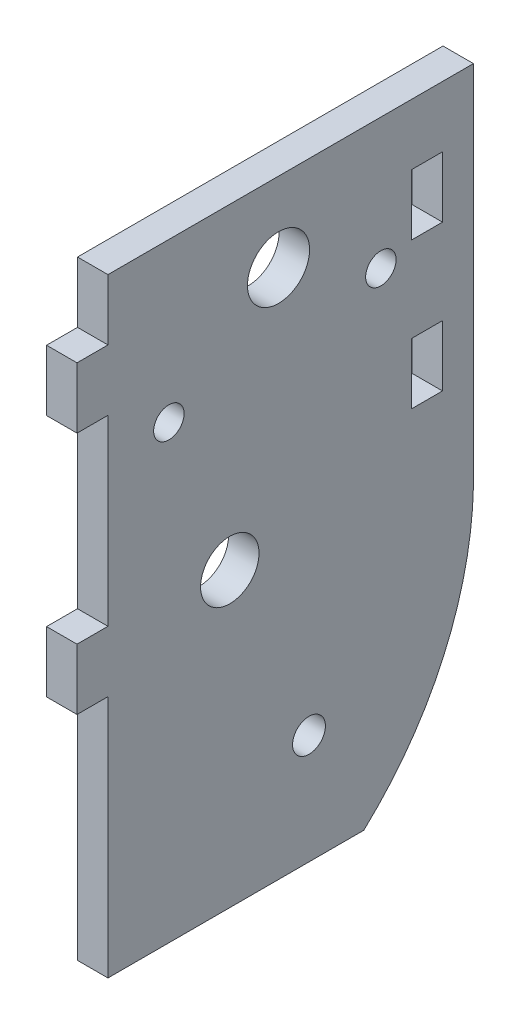
ISO-10303-21;
HEADER;
FILE_DESCRIPTION(('STEP AP214'),'2;1');
FILE_NAME('part.step','',(''),(''),'','','');
FILE_SCHEMA(('AUTOMOTIVE_DESIGN { 1 0 10303 214 1 1 1 1 }'));
ENDSEC;
DATA;
#1=APPLICATION_CONTEXT('core data for automotive mechanical design processes');
#2=APPLICATION_PROTOCOL_DEFINITION('international standard','automotive_design',2000,#1);
#3=PRODUCT_CONTEXT('',#1,'mechanical');
#4=PRODUCT('Part','Part','',(#3));
#5=PRODUCT_RELATED_PRODUCT_CATEGORY('part','',(#4));
#6=PRODUCT_DEFINITION_FORMATION('','',#4);
#7=PRODUCT_DEFINITION_CONTEXT('part definition',#1,'design');
#8=PRODUCT_DEFINITION('design','',#6,#7);
#9=PRODUCT_DEFINITION_SHAPE('','',#8);
#10=(LENGTH_UNIT() NAMED_UNIT(*) SI_UNIT(.MILLI.,.METRE.));
#11=(NAMED_UNIT(*) PLANE_ANGLE_UNIT() SI_UNIT($,.RADIAN.));
#12=(NAMED_UNIT(*) SI_UNIT($,.STERADIAN.) SOLID_ANGLE_UNIT());
#13=UNCERTAINTY_MEASURE_WITH_UNIT(LENGTH_MEASURE(1.E-05),#10,'distance_accuracy_value','');
#14=(GEOMETRIC_REPRESENTATION_CONTEXT(3) GLOBAL_UNCERTAINTY_ASSIGNED_CONTEXT((#13)) GLOBAL_UNIT_ASSIGNED_CONTEXT((#10,
#11,#12)) REPRESENTATION_CONTEXT('',''));
#15=CARTESIAN_POINT('',(0.,0.,0.));
#16=DIRECTION('',(0.,0.,1.));
#17=DIRECTION('',(1.,0.,0.));
#18=AXIS2_PLACEMENT_3D('',#15,#16,#17);
#19=CARTESIAN_POINT('',(3.175,-31.75,19.05));
#20=DIRECTION('',(0.,0.,-1.));
#21=DIRECTION('',(-1.,0.,0.));
#22=AXIS2_PLACEMENT_3D('',#19,#20,#21);
#23=PLANE('',#22);
#24=DIRECTION('',(0.,-1.,0.));
#25=VECTOR('',#24,1.);
#26=CARTESIAN_POINT('',(0.,-31.75,19.05));
#27=LINE('',#26,#25);
#28=CARTESIAN_POINT('',(0.,19.05,19.05));
#29=VERTEX_POINT('',#28);
#30=CARTESIAN_POINT('',(0.,0.,19.05));
#31=VERTEX_POINT('',#30);
#32=EDGE_CURVE('E297',#29,#31,#27,.T.);
#33=ORIENTED_EDGE('',*,*,#32,.T.);
#34=DIRECTION('',(1.,0.,0.));
#35=VECTOR('',#34,1.);
#36=CARTESIAN_POINT('',(0.,0.,19.05));
#37=LINE('',#36,#35);
#38=CARTESIAN_POINT('',(3.175,0.,19.05));
#39=VERTEX_POINT('',#38);
#40=EDGE_CURVE('E257',#31,#39,#37,.T.);
#41=ORIENTED_EDGE('',*,*,#40,.T.);
#42=DIRECTION('',(0.,-1.,0.));
#43=VECTOR('',#42,1.);
#44=CARTESIAN_POINT('',(3.175,-31.75,19.05));
#45=LINE('',#44,#43);
#46=CARTESIAN_POINT('',(3.175,19.05,19.05));
#47=VERTEX_POINT('',#46);
#48=EDGE_CURVE('E336',#47,#39,#45,.T.);
#49=ORIENTED_EDGE('',*,*,#48,.F.);
#50=DIRECTION('',(1.,0.,0.));
#51=VECTOR('',#50,1.);
#52=CARTESIAN_POINT('',(0.,19.05,19.05));
#53=LINE('',#52,#51);
#54=EDGE_CURVE('E280',#29,#47,#53,.T.);
#55=ORIENTED_EDGE('',*,*,#54,.F.);
#56=EDGE_LOOP('',(#33,#41,#49,#55));
#57=FACE_BOUND('',#56,.T.);
#58=ADVANCED_FACE('F33',(#57),#23,.F.);
#59=CARTESIAN_POINT('',(3.175,-6.35,19.05));
#60=VERTEX_POINT('',#59);
#61=CARTESIAN_POINT('',(3.175,-31.75,19.05));
#62=VERTEX_POINT('',#61);
#63=EDGE_CURVE('E299',#60,#62,#45,.T.);
#64=ORIENTED_EDGE('',*,*,#63,.F.);
#65=DIRECTION('',(1.,0.,0.));
#66=VECTOR('',#65,1.);
#67=CARTESIAN_POINT('',(0.,-6.35,19.05));
#68=LINE('',#67,#66);
#69=CARTESIAN_POINT('',(0.,-6.35,19.05));
#70=VERTEX_POINT('',#69);
#71=EDGE_CURVE('E260',#70,#60,#68,.T.);
#72=ORIENTED_EDGE('',*,*,#71,.F.);
#73=CARTESIAN_POINT('',(0.,-31.75,19.05));
#74=VERTEX_POINT('',#73);
#75=EDGE_CURVE('E294',#70,#74,#27,.T.);
#76=ORIENTED_EDGE('',*,*,#75,.T.);
#77=DIRECTION('',(-1.,0.,0.));
#78=VECTOR('',#77,1.);
#79=CARTESIAN_POINT('',(3.175,-31.75,19.05));
#80=LINE('',#79,#78);
#81=EDGE_CURVE('E322',#62,#74,#80,.T.);
#82=ORIENTED_EDGE('',*,*,#81,.F.);
#83=EDGE_LOOP('',(#64,#72,#76,#82));
#84=FACE_BOUND('',#83,.T.);
#85=ADVANCED_FACE('F401',(#84),#23,.F.);
#86=CARTESIAN_POINT('',(3.175,-31.75,-19.05));
#87=DIRECTION('',(0.,0.,1.));
#88=DIRECTION('',(1.,0.,0.));
#89=AXIS2_PLACEMENT_3D('',#86,#87,#88);
#90=PLANE('',#89);
#91=DIRECTION('',(0.,1.,0.));
#92=VECTOR('',#91,1.);
#93=CARTESIAN_POINT('',(3.175,-31.75,-19.05));
#94=LINE('',#93,#92);
#95=CARTESIAN_POINT('',(3.175,-6.35,-19.05));
#96=VERTEX_POINT('',#95);
#97=CARTESIAN_POINT('',(3.175,31.75,-19.05));
#98=VERTEX_POINT('',#97);
#99=EDGE_CURVE('E370',#96,#98,#94,.T.);
#100=ORIENTED_EDGE('',*,*,#99,.F.);
#101=DIRECTION('',(1.,0.,0.));
#102=VECTOR('',#101,1.);
#103=CARTESIAN_POINT('',(-5.00000000001367E-05,-6.35,-19.05));
#104=LINE('',#103,#102);
#105=CARTESIAN_POINT('',(0.,-6.35,-19.05));
#106=VERTEX_POINT('',#105);
#107=EDGE_CURVE('E225',#106,#96,#104,.T.);
#108=ORIENTED_EDGE('',*,*,#107,.F.);
#109=DIRECTION('',(0.,1.,0.));
#110=VECTOR('',#109,1.);
#111=CARTESIAN_POINT('',(0.,-31.75,-19.05));
#112=LINE('',#111,#110);
#113=CARTESIAN_POINT('',(0.,31.75,-19.05));
#114=VERTEX_POINT('',#113);
#115=EDGE_CURVE('E283',#106,#114,#112,.T.);
#116=ORIENTED_EDGE('',*,*,#115,.T.);
#117=DIRECTION('',(-1.,0.,0.));
#118=VECTOR('',#117,1.);
#119=CARTESIAN_POINT('',(3.175,31.75,-19.05));
#120=LINE('',#119,#118);
#121=EDGE_CURVE('E316',#98,#114,#120,.T.);
#122=ORIENTED_EDGE('',*,*,#121,.F.);
#123=EDGE_LOOP('',(#100,#108,#116,#122));
#124=FACE_BOUND('',#123,.T.);
#125=ADVANCED_FACE('F35',(#124),#90,.F.);
#126=CARTESIAN_POINT('',(3.175,31.75,19.05));
#127=DIRECTION('',(0.,-1.,0.));
#128=DIRECTION('',(0.,0.,-1.));
#129=AXIS2_PLACEMENT_3D('',#126,#127,#128);
#130=PLANE('',#129);
#131=DIRECTION('',(0.,0.,1.));
#132=VECTOR('',#131,1.);
#133=CARTESIAN_POINT('',(0.,31.75,19.05));
#134=LINE('',#133,#132);
#135=CARTESIAN_POINT('',(0.,31.75,19.05));
#136=VERTEX_POINT('',#135);
#137=EDGE_CURVE('E298',#114,#136,#134,.T.);
#138=ORIENTED_EDGE('',*,*,#137,.T.);
#139=DIRECTION('',(-1.,0.,0.));
#140=VECTOR('',#139,1.);
#141=CARTESIAN_POINT('',(3.175,31.75,19.05));
#142=LINE('',#141,#140);
#143=CARTESIAN_POINT('',(3.175,31.75,19.05));
#144=VERTEX_POINT('',#143);
#145=EDGE_CURVE('E320',#144,#136,#142,.T.);
#146=ORIENTED_EDGE('',*,*,#145,.F.);
#147=DIRECTION('',(0.,0.,1.));
#148=VECTOR('',#147,1.);
#149=CARTESIAN_POINT('',(3.175,31.75,19.05));
#150=LINE('',#149,#148);
#151=EDGE_CURVE('E371',#98,#144,#150,.T.);
#152=ORIENTED_EDGE('',*,*,#151,.F.);
#153=ORIENTED_EDGE('',*,*,#121,.T.);
#154=EDGE_LOOP('',(#138,#146,#152,#153));
#155=FACE_BOUND('',#154,.T.);
#156=ADVANCED_FACE('F346',(#155),#130,.F.);
#157=CARTESIAN_POINT('',(0.,25.4,19.05));
#158=VERTEX_POINT('',#157);
#159=EDGE_CURVE('E313',#136,#158,#27,.T.);
#160=ORIENTED_EDGE('',*,*,#159,.T.);
#161=DIRECTION('',(1.,0.,0.));
#162=VECTOR('',#161,1.);
#163=CARTESIAN_POINT('',(0.,25.4,19.05));
#164=LINE('',#163,#162);
#165=CARTESIAN_POINT('',(3.175,25.4,19.05));
#166=VERTEX_POINT('',#165);
#167=EDGE_CURVE('E287',#158,#166,#164,.T.);
#168=ORIENTED_EDGE('',*,*,#167,.T.);
#169=EDGE_CURVE('E331',#144,#166,#45,.T.);
#170=ORIENTED_EDGE('',*,*,#169,.F.);
#171=ORIENTED_EDGE('',*,*,#145,.T.);
#172=EDGE_LOOP('',(#160,#168,#170,#171));
#173=FACE_BOUND('',#172,.T.);
#174=ADVANCED_FACE('F352',(#173),#23,.F.);
#175=CARTESIAN_POINT('',(3.175,-31.75,19.05));
#176=DIRECTION('',(0.,1.,0.));
#177=DIRECTION('',(0.,0.,1.));
#178=AXIS2_PLACEMENT_3D('',#175,#176,#177);
#179=PLANE('',#178);
#180=DIRECTION('',(0.,0.,-1.));
#181=VECTOR('',#180,1.);
#182=CARTESIAN_POINT('',(0.,-31.75,19.05));
#183=LINE('',#182,#181);
#184=CARTESIAN_POINT('',(0.,-31.75,-7.62));
#185=VERTEX_POINT('',#184);
#186=EDGE_CURVE('E306',#74,#185,#183,.T.);
#187=ORIENTED_EDGE('',*,*,#186,.T.);
#188=DIRECTION('',(1.,0.,0.));
#189=VECTOR('',#188,1.);
#190=CARTESIAN_POINT('',(-5.00000000001367E-05,-31.75,-7.62));
#191=LINE('',#190,#189);
#192=CARTESIAN_POINT('',(3.175,-31.75,-7.62));
#193=VERTEX_POINT('',#192);
#194=EDGE_CURVE('E226',#185,#193,#191,.T.);
#195=ORIENTED_EDGE('',*,*,#194,.T.);
#196=DIRECTION('',(0.,0.,-1.));
#197=VECTOR('',#196,1.);
#198=CARTESIAN_POINT('',(3.175,-31.75,19.05));
#199=LINE('',#198,#197);
#200=EDGE_CURVE('E324',#62,#193,#199,.T.);
#201=ORIENTED_EDGE('',*,*,#200,.F.);
#202=ORIENTED_EDGE('',*,*,#81,.T.);
#203=EDGE_LOOP('',(#187,#195,#201,#202));
#204=FACE_BOUND('',#203,.T.);
#205=ADVANCED_FACE('F402',(#204),#179,.F.);
#206=CARTESIAN_POINT('',(3.175,31.75,-19.05));
#207=DIRECTION('',(-1.,0.,0.));
#208=DIRECTION('',(0.,0.,1.));
#209=AXIS2_PLACEMENT_3D('',#206,#207,#208);
#210=PLANE('',#209);
#211=CARTESIAN_POINT('',(3.175,18.0975,-9.39799999999999));
#212=DIRECTION('',(-1.,0.,0.));
#213=DIRECTION('',(0.,0.,1.));
#214=AXIS2_PLACEMENT_3D('',#211,#212,#213);
#215=CIRCLE('',#214,1.5875);
#216=CARTESIAN_POINT('',(3.175,18.0975,-7.81049999999999));
#217=VERTEX_POINT('',#216);
#218=EDGE_CURVE('E440',#217,#217,#215,.T.);
#219=ORIENTED_EDGE('',*,*,#218,.T.);
#220=EDGE_LOOP('',(#219));
#221=FACE_BOUND('',#220,.T.);
#222=CARTESIAN_POINT('',(3.175,15.24,12.7));
#223=DIRECTION('',(-1.,0.,0.));
#224=DIRECTION('',(0.,0.,1.));
#225=AXIS2_PLACEMENT_3D('',#222,#223,#224);
#226=CIRCLE('',#225,1.5875);
#227=CARTESIAN_POINT('',(3.175,15.24,14.2875));
#228=VERTEX_POINT('',#227);
#229=EDGE_CURVE('E434',#228,#228,#226,.T.);
#230=ORIENTED_EDGE('',*,*,#229,.T.);
#231=EDGE_LOOP('',(#230));
#232=FACE_BOUND('',#231,.T.);
#233=CARTESIAN_POINT('',(3.175,-1.27,6.35));
#234=DIRECTION('',(-1.,0.,0.));
#235=DIRECTION('',(0.,0.,1.));
#236=AXIS2_PLACEMENT_3D('',#233,#234,#235);
#237=CIRCLE('',#236,3.048);
#238=CARTESIAN_POINT('',(3.175,-1.27,9.39800000000001));
#239=VERTEX_POINT('',#238);
#240=EDGE_CURVE('E427',#239,#239,#237,.T.);
#241=ORIENTED_EDGE('',*,*,#240,.T.);
#242=EDGE_LOOP('',(#241));
#243=FACE_BOUND('',#242,.T.);
#244=DIRECTION('',(0.,0.,1.));
#245=VECTOR('',#244,1.);
#246=CARTESIAN_POINT('',(3.175,10.16,-12.5984));
#247=LINE('',#246,#245);
#248=CARTESIAN_POINT('',(3.175,10.16,-15.8242));
#249=VERTEX_POINT('',#248);
#250=CARTESIAN_POINT('',(3.175,10.16,-12.5984));
#251=VERTEX_POINT('',#250);
#252=EDGE_CURVE('E187',#249,#251,#247,.T.);
#253=ORIENTED_EDGE('',*,*,#252,.F.);
#254=DIRECTION('',(0.,1.,0.));
#255=VECTOR('',#254,1.);
#256=CARTESIAN_POINT('',(3.175,10.16,-15.8242));
#257=LINE('',#256,#255);
#258=CARTESIAN_POINT('',(3.175,3.81,-15.8242));
#259=VERTEX_POINT('',#258);
#260=EDGE_CURVE('E48',#259,#249,#257,.T.);
#261=ORIENTED_EDGE('',*,*,#260,.F.);
#262=DIRECTION('',(0.,0.,-1.));
#263=VECTOR('',#262,1.);
#264=CARTESIAN_POINT('',(3.175,3.81,-12.5984));
#265=LINE('',#264,#263);
#266=CARTESIAN_POINT('',(3.175,3.81,-12.5984));
#267=VERTEX_POINT('',#266);
#268=EDGE_CURVE('E194',#267,#259,#265,.T.);
#269=ORIENTED_EDGE('',*,*,#268,.F.);
#270=DIRECTION('',(0.,-1.,0.));
#271=VECTOR('',#270,1.);
#272=CARTESIAN_POINT('',(3.175,10.16,-12.5984));
#273=LINE('',#272,#271);
#274=EDGE_CURVE('E178',#251,#267,#273,.T.);
#275=ORIENTED_EDGE('',*,*,#274,.F.);
#276=EDGE_LOOP('',(#253,#261,#269,#275));
#277=FACE_BOUND('',#276,.T.);
#278=DIRECTION('',(0.,0.,1.));
#279=VECTOR('',#278,1.);
#280=CARTESIAN_POINT('',(3.175,25.4,-12.5984));
#281=LINE('',#280,#279);
#282=CARTESIAN_POINT('',(3.175,25.4,-15.8242));
#283=VERTEX_POINT('',#282);
#284=CARTESIAN_POINT('',(3.175,25.4,-12.5984));
#285=VERTEX_POINT('',#284);
#286=EDGE_CURVE('E205',#283,#285,#281,.T.);
#287=ORIENTED_EDGE('',*,*,#286,.F.);
#288=DIRECTION('',(0.,1.,0.));
#289=VECTOR('',#288,1.);
#290=CARTESIAN_POINT('',(3.175,25.4,-15.8242));
#291=LINE('',#290,#289);
#292=CARTESIAN_POINT('',(3.175,19.05,-15.8242));
#293=VERTEX_POINT('',#292);
#294=EDGE_CURVE('E201',#293,#283,#291,.T.);
#295=ORIENTED_EDGE('',*,*,#294,.F.);
#296=DIRECTION('',(0.,0.,-1.));
#297=VECTOR('',#296,1.);
#298=CARTESIAN_POINT('',(3.175,19.05,-12.5984));
#299=LINE('',#298,#297);
#300=CARTESIAN_POINT('',(3.175,19.05,-12.5984));
#301=VERTEX_POINT('',#300);
#302=EDGE_CURVE('E211',#301,#293,#299,.T.);
#303=ORIENTED_EDGE('',*,*,#302,.F.);
#304=DIRECTION('',(0.,-1.,0.));
#305=VECTOR('',#304,1.);
#306=CARTESIAN_POINT('',(3.175,25.4,-12.5984));
#307=LINE('',#306,#305);
#308=EDGE_CURVE('E208',#285,#301,#307,.T.);
#309=ORIENTED_EDGE('',*,*,#308,.F.);
#310=EDGE_LOOP('',(#287,#295,#303,#309));
#311=FACE_BOUND('',#310,.T.);
#312=CARTESIAN_POINT('',(3.175,23.495,1.27000000000001));
#313=DIRECTION('',(1.,0.,0.));
#314=DIRECTION('',(0.,0.,-1.));
#315=AXIS2_PLACEMENT_3D('',#312,#313,#314);
#316=CIRCLE('',#315,3.2385);
#317=CARTESIAN_POINT('',(3.175,23.495,-1.96849999999999));
#318=VERTEX_POINT('',#317);
#319=EDGE_CURVE('E229',#318,#318,#316,.T.);
#320=ORIENTED_EDGE('',*,*,#319,.F.);
#321=EDGE_LOOP('',(#320));
#322=FACE_BOUND('',#321,.T.);
#323=CARTESIAN_POINT('',(3.175,-20.32,-1.90499999999999));
#324=DIRECTION('',(1.,0.,0.));
#325=DIRECTION('',(0.,0.,-1.));
#326=AXIS2_PLACEMENT_3D('',#323,#324,#325);
#327=CIRCLE('',#326,1.7145);
#328=CARTESIAN_POINT('',(3.175,-20.32,-3.61949999999999));
#329=VERTEX_POINT('',#328);
#330=EDGE_CURVE('E234',#329,#329,#327,.T.);
#331=ORIENTED_EDGE('',*,*,#330,.F.);
#332=EDGE_LOOP('',(#331));
#333=FACE_BOUND('',#332,.T.);
#334=ORIENTED_EDGE('',*,*,#200,.T.);
#335=CARTESIAN_POINT('',(3.175,-5.62309366721289,16.5025696284158));
#336=DIRECTION('',(-1.,0.,0.));
#337=DIRECTION('',(0.,0.,1.));
#338=AXIS2_PLACEMENT_3D('',#335,#336,#337);
#339=CIRCLE('',#338,35.56);
#340=EDGE_CURVE('E217',#96,#193,#339,.T.);
#341=ORIENTED_EDGE('',*,*,#340,.F.);
#342=ORIENTED_EDGE('',*,*,#99,.T.);
#343=ORIENTED_EDGE('',*,*,#151,.T.);
#344=ORIENTED_EDGE('',*,*,#169,.T.);
#345=DIRECTION('',(0.,0.,1.));
#346=VECTOR('',#345,1.);
#347=CARTESIAN_POINT('',(3.175,25.4,19.05));
#348=LINE('',#347,#346);
#349=CARTESIAN_POINT('',(3.175,25.4,22.2758));
#350=VERTEX_POINT('',#349);
#351=EDGE_CURVE('E259',#166,#350,#348,.T.);
#352=ORIENTED_EDGE('',*,*,#351,.T.);
#353=DIRECTION('',(0.,-1.,0.));
#354=VECTOR('',#353,1.);
#355=CARTESIAN_POINT('',(3.175,25.4,22.2758));
#356=LINE('',#355,#354);
#357=CARTESIAN_POINT('',(3.175,19.05,22.2758));
#358=VERTEX_POINT('',#357);
#359=EDGE_CURVE('E271',#350,#358,#356,.T.);
#360=ORIENTED_EDGE('',*,*,#359,.T.);
#361=DIRECTION('',(0.,0.,-1.));
#362=VECTOR('',#361,1.);
#363=CARTESIAN_POINT('',(3.175,19.05,22.2758));
#364=LINE('',#363,#362);
#365=EDGE_CURVE('E274',#358,#47,#364,.T.);
#366=ORIENTED_EDGE('',*,*,#365,.T.);
#367=ORIENTED_EDGE('',*,*,#48,.T.);
#368=DIRECTION('',(0.,0.,1.));
#369=VECTOR('',#368,1.);
#370=CARTESIAN_POINT('',(3.175,0.,22.2758));
#371=LINE('',#370,#369);
#372=CARTESIAN_POINT('',(3.175,0.,22.2758));
#373=VERTEX_POINT('',#372);
#374=EDGE_CURVE('E249',#39,#373,#371,.T.);
#375=ORIENTED_EDGE('',*,*,#374,.T.);
#376=DIRECTION('',(0.,-1.,0.));
#377=VECTOR('',#376,1.);
#378=CARTESIAN_POINT('',(3.175,-6.35,22.2758));
#379=LINE('',#378,#377);
#380=CARTESIAN_POINT('',(3.175,-6.35,22.2758));
#381=VERTEX_POINT('',#380);
#382=EDGE_CURVE('E252',#373,#381,#379,.T.);
#383=ORIENTED_EDGE('',*,*,#382,.T.);
#384=DIRECTION('',(0.,0.,-1.));
#385=VECTOR('',#384,1.);
#386=CARTESIAN_POINT('',(3.175,-6.35,19.05));
#387=LINE('',#386,#385);
#388=EDGE_CURVE('E242',#381,#60,#387,.T.);
#389=ORIENTED_EDGE('',*,*,#388,.T.);
#390=ORIENTED_EDGE('',*,*,#63,.T.);
#391=EDGE_LOOP('',(#334,#341,#342,#343,#344,#352,#360,#366,#367,#375,#383,#389,#390));
#392=FACE_BOUND('',#391,.T.);
#393=ADVANCED_FACE('F191',(#221,#232,#243,#277,#311,#322,#333,#392),#210,.F.);
#394=CARTESIAN_POINT('',(0.,31.75,-19.05));
#395=DIRECTION('',(-1.,0.,0.));
#396=DIRECTION('',(0.,0.,1.));
#397=AXIS2_PLACEMENT_3D('',#394,#395,#396);
#398=PLANE('',#397);
#399=CARTESIAN_POINT('',(0.,18.0975,-9.39799999999999));
#400=DIRECTION('',(-1.,0.,0.));
#401=DIRECTION('',(0.,0.,1.));
#402=AXIS2_PLACEMENT_3D('',#399,#400,#401);
#403=CIRCLE('',#402,1.5875);
#404=CARTESIAN_POINT('',(0.,18.0975,-7.81049999999999));
#405=VERTEX_POINT('',#404);
#406=EDGE_CURVE('E443',#405,#405,#403,.T.);
#407=ORIENTED_EDGE('',*,*,#406,.F.);
#408=EDGE_LOOP('',(#407));
#409=FACE_BOUND('',#408,.T.);
#410=CARTESIAN_POINT('',(0.,15.24,12.7));
#411=DIRECTION('',(-1.,0.,0.));
#412=DIRECTION('',(0.,0.,1.));
#413=AXIS2_PLACEMENT_3D('',#410,#411,#412);
#414=CIRCLE('',#413,1.5875);
#415=CARTESIAN_POINT('',(0.,15.24,14.2875));
#416=VERTEX_POINT('',#415);
#417=EDGE_CURVE('E437',#416,#416,#414,.T.);
#418=ORIENTED_EDGE('',*,*,#417,.F.);
#419=EDGE_LOOP('',(#418));
#420=FACE_BOUND('',#419,.T.);
#421=CARTESIAN_POINT('',(0.,-1.27,6.35));
#422=DIRECTION('',(-1.,0.,0.));
#423=DIRECTION('',(0.,0.,1.));
#424=AXIS2_PLACEMENT_3D('',#421,#422,#423);
#425=CIRCLE('',#424,3.048);
#426=CARTESIAN_POINT('',(0.,-1.27,9.39800000000001));
#427=VERTEX_POINT('',#426);
#428=EDGE_CURVE('E429',#427,#427,#425,.T.);
#429=ORIENTED_EDGE('',*,*,#428,.F.);
#430=EDGE_LOOP('',(#429));
#431=FACE_BOUND('',#430,.T.);
#432=DIRECTION('',(0.,-1.,0.));
#433=VECTOR('',#432,1.);
#434=CARTESIAN_POINT('',(0.,31.75,-15.8242));
#435=LINE('',#434,#433);
#436=CARTESIAN_POINT('',(0.,10.16,-15.8242));
#437=VERTEX_POINT('',#436);
#438=CARTESIAN_POINT('',(0.,3.81,-15.8242));
#439=VERTEX_POINT('',#438);
#440=EDGE_CURVE('E11',#437,#439,#435,.T.);
#441=ORIENTED_EDGE('',*,*,#440,.F.);
#442=DIRECTION('',(0.,0.,-1.));
#443=VECTOR('',#442,1.);
#444=CARTESIAN_POINT('',(0.,10.16,-19.05));
#445=LINE('',#444,#443);
#446=CARTESIAN_POINT('',(0.,10.16,-12.5984));
#447=VERTEX_POINT('',#446);
#448=EDGE_CURVE('E417',#447,#437,#445,.T.);
#449=ORIENTED_EDGE('',*,*,#448,.F.);
#450=DIRECTION('',(0.,1.,0.));
#451=VECTOR('',#450,1.);
#452=CARTESIAN_POINT('',(0.,31.75,-12.5984));
#453=LINE('',#452,#451);
#454=CARTESIAN_POINT('',(0.,3.81,-12.5984));
#455=VERTEX_POINT('',#454);
#456=EDGE_CURVE('E181',#455,#447,#453,.T.);
#457=ORIENTED_EDGE('',*,*,#456,.F.);
#458=DIRECTION('',(0.,0.,1.));
#459=VECTOR('',#458,1.);
#460=CARTESIAN_POINT('',(0.,3.81,-19.05));
#461=LINE('',#460,#459);
#462=EDGE_CURVE('E41',#439,#455,#461,.T.);
#463=ORIENTED_EDGE('',*,*,#462,.F.);
#464=EDGE_LOOP('',(#441,#449,#457,#463));
#465=FACE_BOUND('',#464,.T.);
#466=DIRECTION('',(0.,-1.,0.));
#467=VECTOR('',#466,1.);
#468=CARTESIAN_POINT('',(0.,31.75,-15.8242));
#469=LINE('',#468,#467);
#470=CARTESIAN_POINT('',(0.,25.4,-15.8242));
#471=VERTEX_POINT('',#470);
#472=CARTESIAN_POINT('',(0.,19.05,-15.8242));
#473=VERTEX_POINT('',#472);
#474=EDGE_CURVE('E415',#471,#473,#469,.T.);
#475=ORIENTED_EDGE('',*,*,#474,.F.);
#476=DIRECTION('',(0.,0.,-1.));
#477=VECTOR('',#476,1.);
#478=CARTESIAN_POINT('',(0.,25.4,-19.05));
#479=LINE('',#478,#477);
#480=CARTESIAN_POINT('',(0.,25.4,-12.5984));
#481=VERTEX_POINT('',#480);
#482=EDGE_CURVE('E405',#481,#471,#479,.T.);
#483=ORIENTED_EDGE('',*,*,#482,.F.);
#484=DIRECTION('',(0.,1.,0.));
#485=VECTOR('',#484,1.);
#486=CARTESIAN_POINT('',(0.,31.75,-12.5984));
#487=LINE('',#486,#485);
#488=CARTESIAN_POINT('',(0.,19.05,-12.5984));
#489=VERTEX_POINT('',#488);
#490=EDGE_CURVE('E407',#489,#481,#487,.T.);
#491=ORIENTED_EDGE('',*,*,#490,.F.);
#492=DIRECTION('',(0.,0.,1.));
#493=VECTOR('',#492,1.);
#494=CARTESIAN_POINT('',(0.,19.05,-19.05));
#495=LINE('',#494,#493);
#496=EDGE_CURVE('E413',#473,#489,#495,.T.);
#497=ORIENTED_EDGE('',*,*,#496,.F.);
#498=EDGE_LOOP('',(#475,#483,#491,#497));
#499=FACE_BOUND('',#498,.T.);
#500=CARTESIAN_POINT('',(0.,-5.62309366721289,16.5025696284158));
#501=DIRECTION('',(-1.,0.,0.));
#502=DIRECTION('',(0.,0.,1.));
#503=AXIS2_PLACEMENT_3D('',#500,#501,#502);
#504=CIRCLE('',#503,35.56);
#505=EDGE_CURVE('E319',#185,#106,#504,.F.);
#506=ORIENTED_EDGE('',*,*,#505,.F.);
#507=ORIENTED_EDGE('',*,*,#186,.F.);
#508=ORIENTED_EDGE('',*,*,#75,.F.);
#509=DIRECTION('',(0.,0.,-1.));
#510=VECTOR('',#509,1.);
#511=CARTESIAN_POINT('',(0.,-6.35,19.05));
#512=LINE('',#511,#510);
#513=CARTESIAN_POINT('',(0.,-6.35,22.2758));
#514=VERTEX_POINT('',#513);
#515=EDGE_CURVE('E245',#514,#70,#512,.T.);
#516=ORIENTED_EDGE('',*,*,#515,.F.);
#517=DIRECTION('',(0.,-1.,0.));
#518=VECTOR('',#517,1.);
#519=CARTESIAN_POINT('',(0.,-6.35,22.2758));
#520=LINE('',#519,#518);
#521=CARTESIAN_POINT('',(0.,0.,22.2758));
#522=VERTEX_POINT('',#521);
#523=EDGE_CURVE('E241',#522,#514,#520,.T.);
#524=ORIENTED_EDGE('',*,*,#523,.F.);
#525=DIRECTION('',(0.,0.,1.));
#526=VECTOR('',#525,1.);
#527=CARTESIAN_POINT('',(0.,0.,22.2758));
#528=LINE('',#527,#526);
#529=EDGE_CURVE('E238',#31,#522,#528,.T.);
#530=ORIENTED_EDGE('',*,*,#529,.F.);
#531=ORIENTED_EDGE('',*,*,#32,.F.);
#532=DIRECTION('',(0.,0.,-1.));
#533=VECTOR('',#532,1.);
#534=CARTESIAN_POINT('',(0.,19.05,22.2758));
#535=LINE('',#534,#533);
#536=CARTESIAN_POINT('',(0.,19.05,22.2758));
#537=VERTEX_POINT('',#536);
#538=EDGE_CURVE('E269',#537,#29,#535,.T.);
#539=ORIENTED_EDGE('',*,*,#538,.F.);
#540=DIRECTION('',(0.,-1.,0.));
#541=VECTOR('',#540,1.);
#542=CARTESIAN_POINT('',(0.,25.4,22.2758));
#543=LINE('',#542,#541);
#544=CARTESIAN_POINT('',(0.,25.4,22.2758));
#545=VERTEX_POINT('',#544);
#546=EDGE_CURVE('E266',#545,#537,#543,.T.);
#547=ORIENTED_EDGE('',*,*,#546,.F.);
#548=DIRECTION('',(0.,0.,1.));
#549=VECTOR('',#548,1.);
#550=CARTESIAN_POINT('',(0.,25.4,19.05));
#551=LINE('',#550,#549);
#552=EDGE_CURVE('E270',#158,#545,#551,.T.);
#553=ORIENTED_EDGE('',*,*,#552,.F.);
#554=ORIENTED_EDGE('',*,*,#159,.F.);
#555=ORIENTED_EDGE('',*,*,#137,.F.);
#556=ORIENTED_EDGE('',*,*,#115,.F.);
#557=EDGE_LOOP('',(#506,#507,#508,#516,#524,#530,#531,#539,#547,#553,#554,#555,#556));
#558=FACE_BOUND('',#557,.T.);
#559=CARTESIAN_POINT('',(0.,23.495,1.27000000000001));
#560=DIRECTION('',(-1.,0.,0.));
#561=DIRECTION('',(0.,0.,1.));
#562=AXIS2_PLACEMENT_3D('',#559,#560,#561);
#563=CIRCLE('',#562,3.2385);
#564=CARTESIAN_POINT('',(0.,23.495,4.50850000000001));
#565=VERTEX_POINT('',#564);
#566=EDGE_CURVE('E233',#565,#565,#563,.T.);
#567=ORIENTED_EDGE('',*,*,#566,.F.);
#568=EDGE_LOOP('',(#567));
#569=FACE_BOUND('',#568,.T.);
#570=CARTESIAN_POINT('',(0.,-20.32,-1.90499999999999));
#571=DIRECTION('',(-1.,0.,0.));
#572=DIRECTION('',(0.,0.,1.));
#573=AXIS2_PLACEMENT_3D('',#570,#571,#572);
#574=CIRCLE('',#573,1.7145);
#575=CARTESIAN_POINT('',(0.,-20.32,-0.190499999999994));
#576=VERTEX_POINT('',#575);
#577=EDGE_CURVE('E237',#576,#576,#574,.T.);
#578=ORIENTED_EDGE('',*,*,#577,.F.);
#579=EDGE_LOOP('',(#578));
#580=FACE_BOUND('',#579,.T.);
#581=ADVANCED_FACE('F356',(#409,#420,#431,#465,#499,#558,#569,#580),#398,.T.);
#582=CARTESIAN_POINT('',(0.,19.05,22.2758));
#583=DIRECTION('',(0.,-1.,0.));
#584=DIRECTION('',(0.,0.,-1.));
#585=AXIS2_PLACEMENT_3D('',#582,#583,#584);
#586=PLANE('',#585);
#587=ORIENTED_EDGE('',*,*,#365,.F.);
#588=DIRECTION('',(1.,0.,0.));
#589=VECTOR('',#588,1.);
#590=CARTESIAN_POINT('',(0.,19.05,22.2758));
#591=LINE('',#590,#589);
#592=EDGE_CURVE('E277',#537,#358,#591,.T.);
#593=ORIENTED_EDGE('',*,*,#592,.F.);
#594=ORIENTED_EDGE('',*,*,#538,.T.);
#595=ORIENTED_EDGE('',*,*,#54,.T.);
#596=EDGE_LOOP('',(#587,#593,#594,#595));
#597=FACE_BOUND('',#596,.T.);
#598=ADVANCED_FACE('F383',(#597),#586,.T.);
#599=CARTESIAN_POINT('',(0.,25.4,22.2758));
#600=DIRECTION('',(0.,0.,1.));
#601=DIRECTION('',(0.,-1.,0.));
#602=AXIS2_PLACEMENT_3D('',#599,#600,#601);
#603=PLANE('',#602);
#604=ORIENTED_EDGE('',*,*,#359,.F.);
#605=DIRECTION('',(1.,0.,0.));
#606=VECTOR('',#605,1.);
#607=CARTESIAN_POINT('',(0.,25.4,22.2758));
#608=LINE('',#607,#606);
#609=EDGE_CURVE('E365',#545,#350,#608,.T.);
#610=ORIENTED_EDGE('',*,*,#609,.F.);
#611=ORIENTED_EDGE('',*,*,#546,.T.);
#612=ORIENTED_EDGE('',*,*,#592,.T.);
#613=EDGE_LOOP('',(#604,#610,#611,#612));
#614=FACE_BOUND('',#613,.T.);
#615=ADVANCED_FACE('F381',(#614),#603,.T.);
#616=CARTESIAN_POINT('',(0.,25.4,19.05));
#617=DIRECTION('',(0.,1.,0.));
#618=DIRECTION('',(0.,0.,1.));
#619=AXIS2_PLACEMENT_3D('',#616,#617,#618);
#620=PLANE('',#619);
#621=ORIENTED_EDGE('',*,*,#351,.F.);
#622=ORIENTED_EDGE('',*,*,#167,.F.);
#623=ORIENTED_EDGE('',*,*,#552,.T.);
#624=ORIENTED_EDGE('',*,*,#609,.T.);
#625=EDGE_LOOP('',(#621,#622,#623,#624));
#626=FACE_BOUND('',#625,.T.);
#627=ADVANCED_FACE('F379',(#626),#620,.T.);
#628=CARTESIAN_POINT('',(0.,0.,22.2758));
#629=DIRECTION('',(0.,1.,0.));
#630=DIRECTION('',(0.,0.,1.));
#631=AXIS2_PLACEMENT_3D('',#628,#629,#630);
#632=PLANE('',#631);
#633=ORIENTED_EDGE('',*,*,#374,.F.);
#634=ORIENTED_EDGE('',*,*,#40,.F.);
#635=ORIENTED_EDGE('',*,*,#529,.T.);
#636=DIRECTION('',(1.,0.,0.));
#637=VECTOR('',#636,1.);
#638=CARTESIAN_POINT('',(0.,0.,22.2758));
#639=LINE('',#638,#637);
#640=EDGE_CURVE('E248',#522,#373,#639,.T.);
#641=ORIENTED_EDGE('',*,*,#640,.T.);
#642=EDGE_LOOP('',(#633,#634,#635,#641));
#643=FACE_BOUND('',#642,.T.);
#644=ADVANCED_FACE('F390',(#643),#632,.T.);
#645=CARTESIAN_POINT('',(0.,-6.35,19.05));
#646=DIRECTION('',(0.,-1.,0.));
#647=DIRECTION('',(0.,0.,-1.));
#648=AXIS2_PLACEMENT_3D('',#645,#646,#647);
#649=PLANE('',#648);
#650=ORIENTED_EDGE('',*,*,#388,.F.);
#651=DIRECTION('',(1.,0.,0.));
#652=VECTOR('',#651,1.);
#653=CARTESIAN_POINT('',(0.,-6.35,22.2758));
#654=LINE('',#653,#652);
#655=EDGE_CURVE('E263',#514,#381,#654,.T.);
#656=ORIENTED_EDGE('',*,*,#655,.F.);
#657=ORIENTED_EDGE('',*,*,#515,.T.);
#658=ORIENTED_EDGE('',*,*,#71,.T.);
#659=EDGE_LOOP('',(#650,#656,#657,#658));
#660=FACE_BOUND('',#659,.T.);
#661=ADVANCED_FACE('F398',(#660),#649,.T.);
#662=CARTESIAN_POINT('',(0.,-6.35,22.2758));
#663=DIRECTION('',(0.,0.,1.));
#664=DIRECTION('',(1.,0.,0.));
#665=AXIS2_PLACEMENT_3D('',#662,#663,#664);
#666=PLANE('',#665);
#667=ORIENTED_EDGE('',*,*,#382,.F.);
#668=ORIENTED_EDGE('',*,*,#640,.F.);
#669=ORIENTED_EDGE('',*,*,#523,.T.);
#670=ORIENTED_EDGE('',*,*,#655,.T.);
#671=EDGE_LOOP('',(#667,#668,#669,#670));
#672=FACE_BOUND('',#671,.T.);
#673=ADVANCED_FACE('F395',(#672),#666,.T.);
#674=CARTESIAN_POINT('',(-5.00000000001367E-05,-20.32,-1.90499999999999));
#675=DIRECTION('',(1.,0.,0.));
#676=DIRECTION('',(0.,0.,-1.));
#677=AXIS2_PLACEMENT_3D('',#674,#675,#676);
#678=CYLINDRICAL_SURFACE('',#677,1.7145);
#679=ORIENTED_EDGE('',*,*,#577,.T.);
#680=EDGE_LOOP('',(#679));
#681=FACE_BOUND('',#680,.T.);
#682=ORIENTED_EDGE('',*,*,#330,.T.);
#683=EDGE_LOOP('',(#682));
#684=FACE_BOUND('',#683,.T.);
#685=ADVANCED_FACE('F552',(#681,#684),#678,.F.);
#686=CARTESIAN_POINT('',(-5.00000000001367E-05,23.495,1.27000000000001));
#687=DIRECTION('',(1.,0.,0.));
#688=DIRECTION('',(0.,0.,-1.));
#689=AXIS2_PLACEMENT_3D('',#686,#687,#688);
#690=CYLINDRICAL_SURFACE('',#689,3.2385);
#691=ORIENTED_EDGE('',*,*,#566,.T.);
#692=EDGE_LOOP('',(#691));
#693=FACE_BOUND('',#692,.T.);
#694=ORIENTED_EDGE('',*,*,#319,.T.);
#695=EDGE_LOOP('',(#694));
#696=FACE_BOUND('',#695,.T.);
#697=ADVANCED_FACE('F560',(#693,#696),#690,.F.);
#698=CARTESIAN_POINT('',(-5.00000000001367E-05,-5.62309366721289,16.5025696284158));
#699=DIRECTION('',(1.,0.,0.));
#700=DIRECTION('',(0.,0.,-1.));
#701=AXIS2_PLACEMENT_3D('',#698,#699,#700);
#702=CYLINDRICAL_SURFACE('',#701,35.56);
#703=ORIENTED_EDGE('',*,*,#505,.T.);
#704=ORIENTED_EDGE('',*,*,#107,.T.);
#705=ORIENTED_EDGE('',*,*,#340,.T.);
#706=ORIENTED_EDGE('',*,*,#194,.F.);
#707=EDGE_LOOP('',(#703,#704,#705,#706));
#708=FACE_BOUND('',#707,.T.);
#709=ADVANCED_FACE('F404',(#708),#702,.T.);
#710=CARTESIAN_POINT('',(-5.00000000001367E-05,25.4,-15.8242));
#711=DIRECTION('',(0.,0.,-1.));
#712=DIRECTION('',(-1.,0.,0.));
#713=AXIS2_PLACEMENT_3D('',#710,#711,#712);
#714=PLANE('',#713);
#715=ORIENTED_EDGE('',*,*,#474,.T.);
#716=DIRECTION('',(1.,0.,0.));
#717=VECTOR('',#716,1.);
#718=CARTESIAN_POINT('',(-5.00000000001367E-05,19.05,-15.8242));
#719=LINE('',#718,#717);
#720=EDGE_CURVE('E215',#473,#293,#719,.T.);
#721=ORIENTED_EDGE('',*,*,#720,.T.);
#722=ORIENTED_EDGE('',*,*,#294,.T.);
#723=DIRECTION('',(1.,0.,0.));
#724=VECTOR('',#723,1.);
#725=CARTESIAN_POINT('',(-5.00000000001367E-05,25.4,-15.8242));
#726=LINE('',#725,#724);
#727=EDGE_CURVE('E214',#471,#283,#726,.T.);
#728=ORIENTED_EDGE('',*,*,#727,.F.);
#729=EDGE_LOOP('',(#715,#721,#722,#728));
#730=FACE_BOUND('',#729,.T.);
#731=ADVANCED_FACE('F579',(#730),#714,.F.);
#732=CARTESIAN_POINT('',(-5.00000000001367E-05,19.05,-12.5984));
#733=DIRECTION('',(0.,-1.,0.));
#734=DIRECTION('',(0.,0.,-1.));
#735=AXIS2_PLACEMENT_3D('',#732,#733,#734);
#736=PLANE('',#735);
#737=ORIENTED_EDGE('',*,*,#496,.T.);
#738=DIRECTION('',(1.,0.,0.));
#739=VECTOR('',#738,1.);
#740=CARTESIAN_POINT('',(-5.00000000001367E-05,19.05,-12.5984));
#741=LINE('',#740,#739);
#742=EDGE_CURVE('E218',#489,#301,#741,.T.);
#743=ORIENTED_EDGE('',*,*,#742,.T.);
#744=ORIENTED_EDGE('',*,*,#302,.T.);
#745=ORIENTED_EDGE('',*,*,#720,.F.);
#746=EDGE_LOOP('',(#737,#743,#744,#745));
#747=FACE_BOUND('',#746,.T.);
#748=ADVANCED_FACE('F585',(#747),#736,.F.);
#749=CARTESIAN_POINT('',(-5.00000000001367E-05,25.4,-12.5984));
#750=DIRECTION('',(0.,0.,1.));
#751=DIRECTION('',(0.,-1.,0.));
#752=AXIS2_PLACEMENT_3D('',#749,#750,#751);
#753=PLANE('',#752);
#754=ORIENTED_EDGE('',*,*,#490,.T.);
#755=DIRECTION('',(1.,0.,0.));
#756=VECTOR('',#755,1.);
#757=CARTESIAN_POINT('',(-5.00000000001367E-05,25.4,-12.5984));
#758=LINE('',#757,#756);
#759=EDGE_CURVE('E220',#481,#285,#758,.T.);
#760=ORIENTED_EDGE('',*,*,#759,.T.);
#761=ORIENTED_EDGE('',*,*,#308,.T.);
#762=ORIENTED_EDGE('',*,*,#742,.F.);
#763=EDGE_LOOP('',(#754,#760,#761,#762));
#764=FACE_BOUND('',#763,.T.);
#765=ADVANCED_FACE('F593',(#764),#753,.F.);
#766=CARTESIAN_POINT('',(-5.00000000001367E-05,25.4,-12.5984));
#767=DIRECTION('',(0.,1.,0.));
#768=DIRECTION('',(0.,0.,1.));
#769=AXIS2_PLACEMENT_3D('',#766,#767,#768);
#770=PLANE('',#769);
#771=ORIENTED_EDGE('',*,*,#482,.T.);
#772=ORIENTED_EDGE('',*,*,#727,.T.);
#773=ORIENTED_EDGE('',*,*,#286,.T.);
#774=ORIENTED_EDGE('',*,*,#759,.F.);
#775=EDGE_LOOP('',(#771,#772,#773,#774));
#776=FACE_BOUND('',#775,.T.);
#777=ADVANCED_FACE('F601',(#776),#770,.F.);
#778=CARTESIAN_POINT('',(-5.00000000001367E-05,10.16,-15.8242));
#779=DIRECTION('',(0.,0.,-1.));
#780=DIRECTION('',(0.,1.,0.));
#781=AXIS2_PLACEMENT_3D('',#778,#779,#780);
#782=PLANE('',#781);
#783=ORIENTED_EDGE('',*,*,#440,.T.);
#784=DIRECTION('',(1.,0.,0.));
#785=VECTOR('',#784,1.);
#786=CARTESIAN_POINT('',(-5.00000000001367E-05,3.81,-15.8242));
#787=LINE('',#786,#785);
#788=EDGE_CURVE('E199',#439,#259,#787,.T.);
#789=ORIENTED_EDGE('',*,*,#788,.T.);
#790=ORIENTED_EDGE('',*,*,#260,.T.);
#791=DIRECTION('',(1.,0.,0.));
#792=VECTOR('',#791,1.);
#793=CARTESIAN_POINT('',(-5.00000000001367E-05,10.16,-15.8242));
#794=LINE('',#793,#792);
#795=EDGE_CURVE('E184',#437,#249,#794,.T.);
#796=ORIENTED_EDGE('',*,*,#795,.F.);
#797=EDGE_LOOP('',(#783,#789,#790,#796));
#798=FACE_BOUND('',#797,.T.);
#799=ADVANCED_FACE('F426',(#798),#782,.F.);
#800=CARTESIAN_POINT('',(-5.00000000001367E-05,3.81,-12.5984));
#801=DIRECTION('',(0.,-1.,0.));
#802=DIRECTION('',(0.,0.,-1.));
#803=AXIS2_PLACEMENT_3D('',#800,#801,#802);
#804=PLANE('',#803);
#805=ORIENTED_EDGE('',*,*,#462,.T.);
#806=DIRECTION('',(1.,0.,0.));
#807=VECTOR('',#806,1.);
#808=CARTESIAN_POINT('',(-5.00000000001367E-05,3.81,-12.5984));
#809=LINE('',#808,#807);
#810=EDGE_CURVE('E183',#455,#267,#809,.T.);
#811=ORIENTED_EDGE('',*,*,#810,.T.);
#812=ORIENTED_EDGE('',*,*,#268,.T.);
#813=ORIENTED_EDGE('',*,*,#788,.F.);
#814=EDGE_LOOP('',(#805,#811,#812,#813));
#815=FACE_BOUND('',#814,.T.);
#816=ADVANCED_FACE('F422',(#815),#804,.F.);
#817=CARTESIAN_POINT('',(-5.00000000001367E-05,10.16,-12.5984));
#818=DIRECTION('',(0.,0.,1.));
#819=DIRECTION('',(1.,0.,0.));
#820=AXIS2_PLACEMENT_3D('',#817,#818,#819);
#821=PLANE('',#820);
#822=ORIENTED_EDGE('',*,*,#456,.T.);
#823=DIRECTION('',(1.,0.,0.));
#824=VECTOR('',#823,1.);
#825=CARTESIAN_POINT('',(-5.00000000001367E-05,10.16,-12.5984));
#826=LINE('',#825,#824);
#827=EDGE_CURVE('E56',#447,#251,#826,.T.);
#828=ORIENTED_EDGE('',*,*,#827,.T.);
#829=ORIENTED_EDGE('',*,*,#274,.T.);
#830=ORIENTED_EDGE('',*,*,#810,.F.);
#831=EDGE_LOOP('',(#822,#828,#829,#830));
#832=FACE_BOUND('',#831,.T.);
#833=ADVANCED_FACE('F175',(#832),#821,.F.);
#834=CARTESIAN_POINT('',(-5.00000000001367E-05,10.16,-12.5984));
#835=DIRECTION('',(0.,1.,0.));
#836=DIRECTION('',(0.,0.,1.));
#837=AXIS2_PLACEMENT_3D('',#834,#835,#836);
#838=PLANE('',#837);
#839=ORIENTED_EDGE('',*,*,#448,.T.);
#840=ORIENTED_EDGE('',*,*,#795,.T.);
#841=ORIENTED_EDGE('',*,*,#252,.T.);
#842=ORIENTED_EDGE('',*,*,#827,.F.);
#843=EDGE_LOOP('',(#839,#840,#841,#842));
#844=FACE_BOUND('',#843,.T.);
#845=ADVANCED_FACE('F188',(#844),#838,.F.);
#846=CARTESIAN_POINT('',(3.17505,-1.27,6.35));
#847=DIRECTION('',(-1.,0.,0.));
#848=DIRECTION('',(0.,0.,1.));
#849=AXIS2_PLACEMENT_3D('',#846,#847,#848);
#850=CYLINDRICAL_SURFACE('',#849,3.048);
#851=ORIENTED_EDGE('',*,*,#428,.T.);
#852=EDGE_LOOP('',(#851));
#853=FACE_BOUND('',#852,.T.);
#854=ORIENTED_EDGE('',*,*,#240,.F.);
#855=EDGE_LOOP('',(#854));
#856=FACE_BOUND('',#855,.T.);
#857=ADVANCED_FACE('F457',(#853,#856),#850,.F.);
#858=CARTESIAN_POINT('',(3.17505,15.24,12.7));
#859=DIRECTION('',(-1.,0.,0.));
#860=DIRECTION('',(0.,0.,1.));
#861=AXIS2_PLACEMENT_3D('',#858,#859,#860);
#862=CYLINDRICAL_SURFACE('',#861,1.5875);
#863=ORIENTED_EDGE('',*,*,#417,.T.);
#864=EDGE_LOOP('',(#863));
#865=FACE_BOUND('',#864,.T.);
#866=ORIENTED_EDGE('',*,*,#229,.F.);
#867=EDGE_LOOP('',(#866));
#868=FACE_BOUND('',#867,.T.);
#869=ADVANCED_FACE('F460',(#865,#868),#862,.F.);
#870=CARTESIAN_POINT('',(3.17505,18.0975,-9.39799999999999));
#871=DIRECTION('',(-1.,0.,0.));
#872=DIRECTION('',(0.,0.,1.));
#873=AXIS2_PLACEMENT_3D('',#870,#871,#872);
#874=CYLINDRICAL_SURFACE('',#873,1.5875);
#875=ORIENTED_EDGE('',*,*,#406,.T.);
#876=EDGE_LOOP('',(#875));
#877=FACE_BOUND('',#876,.T.);
#878=ORIENTED_EDGE('',*,*,#218,.F.);
#879=EDGE_LOOP('',(#878));
#880=FACE_BOUND('',#879,.T.);
#881=ADVANCED_FACE('F447',(#877,#880),#874,.F.);
#882=CLOSED_SHELL('',(#58,#85,#125,#156,#174,#205,#393,#581,#598,#615,#627,#644,#661,#673,#685,
#697,#709,#731,#748,#765,#777,#799,#816,#833,#845,#857,#869,#881));
#883=MANIFOLD_SOLID_BREP('B2',#882);
#884=ADVANCED_BREP_SHAPE_REPRESENTATION('',(#18,#883),#14);
#885=SHAPE_DEFINITION_REPRESENTATION(#9,#884);
ENDSEC;
END-ISO-10303-21;
